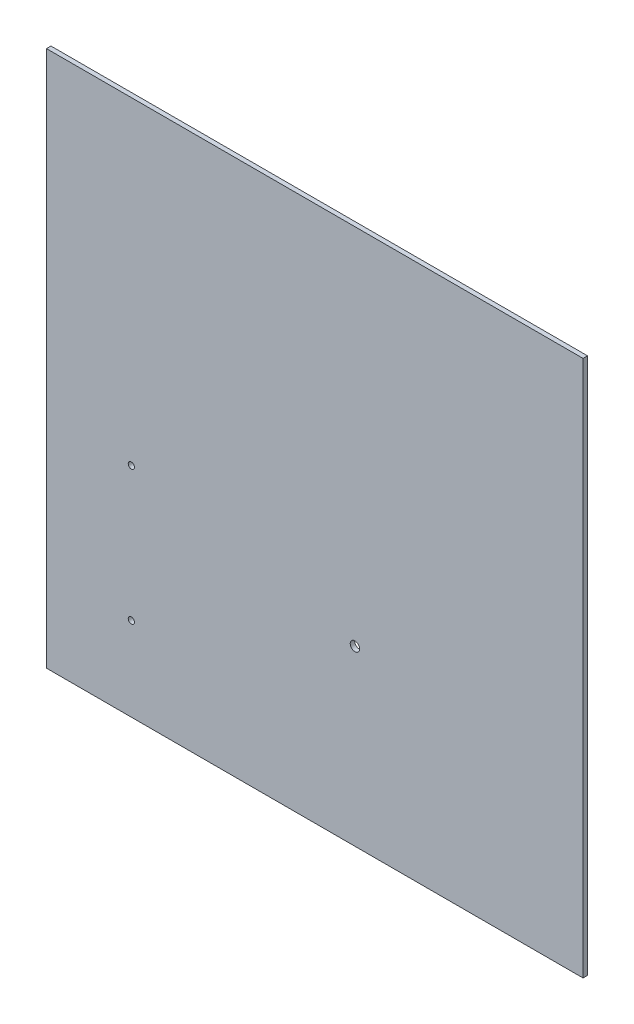
ISO-10303-21;
HEADER;
FILE_DESCRIPTION(('STEP AP214'),'2;1');
FILE_NAME('part.step','',(''),(''),'','','');
FILE_SCHEMA(('AUTOMOTIVE_DESIGN { 1 0 10303 214 1 1 1 1 }'));
ENDSEC;
DATA;
#1=APPLICATION_CONTEXT('core data for automotive mechanical design processes');
#2=APPLICATION_PROTOCOL_DEFINITION('international standard','automotive_design',2000,#1);
#3=PRODUCT_CONTEXT('',#1,'mechanical');
#4=PRODUCT('Part','Part','',(#3));
#5=PRODUCT_RELATED_PRODUCT_CATEGORY('part','',(#4));
#6=PRODUCT_DEFINITION_FORMATION('','',#4);
#7=PRODUCT_DEFINITION_CONTEXT('part definition',#1,'design');
#8=PRODUCT_DEFINITION('design','',#6,#7);
#9=PRODUCT_DEFINITION_SHAPE('','',#8);
#10=(LENGTH_UNIT() NAMED_UNIT(*) SI_UNIT(.MILLI.,.METRE.));
#11=(NAMED_UNIT(*) PLANE_ANGLE_UNIT() SI_UNIT($,.RADIAN.));
#12=(NAMED_UNIT(*) SI_UNIT($,.STERADIAN.) SOLID_ANGLE_UNIT());
#13=UNCERTAINTY_MEASURE_WITH_UNIT(LENGTH_MEASURE(1.E-05),#10,'distance_accuracy_value','');
#14=(GEOMETRIC_REPRESENTATION_CONTEXT(3) GLOBAL_UNCERTAINTY_ASSIGNED_CONTEXT((#13)) GLOBAL_UNIT_ASSIGNED_CONTEXT((#10,
#11,#12)) REPRESENTATION_CONTEXT('',''));
#15=CARTESIAN_POINT('',(0.,0.,0.));
#16=DIRECTION('',(0.,0.,1.));
#17=DIRECTION('',(1.,0.,0.));
#18=AXIS2_PLACEMENT_3D('',#15,#16,#17);
#19=CARTESIAN_POINT('',(0.,0.,2.54));
#20=DIRECTION('',(1.,0.,0.));
#21=DIRECTION('',(0.,0.,-1.));
#22=AXIS2_PLACEMENT_3D('',#19,#20,#21);
#23=PLANE('',#22);
#24=DIRECTION('',(0.,-1.,0.));
#25=VECTOR('',#24,1.);
#26=CARTESIAN_POINT('',(0.,0.,0.));
#27=LINE('',#26,#25);
#28=CARTESIAN_POINT('',(0.,304.8,0.));
#29=VERTEX_POINT('',#28);
#30=CARTESIAN_POINT('',(0.,0.,0.));
#31=VERTEX_POINT('',#30);
#32=EDGE_CURVE('E95',#29,#31,#27,.T.);
#33=ORIENTED_EDGE('',*,*,#32,.T.);
#34=DIRECTION('',(0.,0.,-1.));
#35=VECTOR('',#34,1.);
#36=CARTESIAN_POINT('',(0.,0.,2.54));
#37=LINE('',#36,#35);
#38=CARTESIAN_POINT('',(0.,0.,2.54));
#39=VERTEX_POINT('',#38);
#40=EDGE_CURVE('E11',#39,#31,#37,.T.);
#41=ORIENTED_EDGE('',*,*,#40,.F.);
#42=DIRECTION('',(0.,-1.,0.));
#43=VECTOR('',#42,1.);
#44=CARTESIAN_POINT('',(0.,0.,2.54));
#45=LINE('',#44,#43);
#46=CARTESIAN_POINT('',(0.,304.8,2.54));
#47=VERTEX_POINT('',#46);
#48=EDGE_CURVE('E83',#47,#39,#45,.T.);
#49=ORIENTED_EDGE('',*,*,#48,.F.);
#50=DIRECTION('',(0.,0.,-1.));
#51=VECTOR('',#50,1.);
#52=CARTESIAN_POINT('',(0.,304.8,2.54));
#53=LINE('',#52,#51);
#54=EDGE_CURVE('E91',#47,#29,#53,.T.);
#55=ORIENTED_EDGE('',*,*,#54,.T.);
#56=EDGE_LOOP('',(#33,#41,#49,#55));
#57=FACE_BOUND('',#56,.T.);
#58=ADVANCED_FACE('F32',(#57),#23,.F.);
#59=CARTESIAN_POINT('',(0.,0.,2.54));
#60=DIRECTION('',(0.,1.,0.));
#61=DIRECTION('',(0.,0.,1.));
#62=AXIS2_PLACEMENT_3D('',#59,#60,#61);
#63=PLANE('',#62);
#64=DIRECTION('',(1.,0.,0.));
#65=VECTOR('',#64,1.);
#66=CARTESIAN_POINT('',(0.,0.,0.));
#67=LINE('',#66,#65);
#68=CARTESIAN_POINT('',(304.8,0.,0.));
#69=VERTEX_POINT('',#68);
#70=EDGE_CURVE('E87',#31,#69,#67,.T.);
#71=ORIENTED_EDGE('',*,*,#70,.T.);
#72=DIRECTION('',(0.,0.,-1.));
#73=VECTOR('',#72,1.);
#74=CARTESIAN_POINT('',(304.8,0.,2.54));
#75=LINE('',#74,#73);
#76=CARTESIAN_POINT('',(304.8,0.,2.54));
#77=VERTEX_POINT('',#76);
#78=EDGE_CURVE('E40',#77,#69,#75,.T.);
#79=ORIENTED_EDGE('',*,*,#78,.F.);
#80=DIRECTION('',(1.,0.,0.));
#81=VECTOR('',#80,1.);
#82=CARTESIAN_POINT('',(0.,0.,2.54));
#83=LINE('',#82,#81);
#84=EDGE_CURVE('E78',#39,#77,#83,.T.);
#85=ORIENTED_EDGE('',*,*,#84,.F.);
#86=ORIENTED_EDGE('',*,*,#40,.T.);
#87=EDGE_LOOP('',(#71,#79,#85,#86));
#88=FACE_BOUND('',#87,.T.);
#89=ADVANCED_FACE('F86',(#88),#63,.F.);
#90=CARTESIAN_POINT('',(304.8,0.,2.54));
#91=DIRECTION('',(-1.,0.,0.));
#92=DIRECTION('',(0.,0.,1.));
#93=AXIS2_PLACEMENT_3D('',#90,#91,#92);
#94=PLANE('',#93);
#95=DIRECTION('',(0.,1.,0.));
#96=VECTOR('',#95,1.);
#97=CARTESIAN_POINT('',(304.8,0.,0.));
#98=LINE('',#97,#96);
#99=CARTESIAN_POINT('',(304.8,304.8,0.));
#100=VERTEX_POINT('',#99);
#101=EDGE_CURVE('E65',#69,#100,#98,.T.);
#102=ORIENTED_EDGE('',*,*,#101,.T.);
#103=DIRECTION('',(0.,0.,-1.));
#104=VECTOR('',#103,1.);
#105=CARTESIAN_POINT('',(304.8,304.8,2.54));
#106=LINE('',#105,#104);
#107=CARTESIAN_POINT('',(304.8,304.8,2.54));
#108=VERTEX_POINT('',#107);
#109=EDGE_CURVE('E88',#108,#100,#106,.T.);
#110=ORIENTED_EDGE('',*,*,#109,.F.);
#111=DIRECTION('',(0.,1.,0.));
#112=VECTOR('',#111,1.);
#113=CARTESIAN_POINT('',(304.8,0.,2.54));
#114=LINE('',#113,#112);
#115=EDGE_CURVE('E81',#77,#108,#114,.T.);
#116=ORIENTED_EDGE('',*,*,#115,.F.);
#117=ORIENTED_EDGE('',*,*,#78,.T.);
#118=EDGE_LOOP('',(#102,#110,#116,#117));
#119=FACE_BOUND('',#118,.T.);
#120=ADVANCED_FACE('F89',(#119),#94,.F.);
#121=CARTESIAN_POINT('',(0.,304.8,2.54));
#122=DIRECTION('',(0.,-1.,0.));
#123=DIRECTION('',(0.,0.,-1.));
#124=AXIS2_PLACEMENT_3D('',#121,#122,#123);
#125=PLANE('',#124);
#126=DIRECTION('',(-1.,0.,0.));
#127=VECTOR('',#126,1.);
#128=CARTESIAN_POINT('',(0.,304.8,0.));
#129=LINE('',#128,#127);
#130=EDGE_CURVE('E71',#100,#29,#129,.T.);
#131=ORIENTED_EDGE('',*,*,#130,.T.);
#132=ORIENTED_EDGE('',*,*,#54,.F.);
#133=DIRECTION('',(-1.,0.,0.));
#134=VECTOR('',#133,1.);
#135=CARTESIAN_POINT('',(0.,304.8,2.54));
#136=LINE('',#135,#134);
#137=EDGE_CURVE('E48',#108,#47,#136,.T.);
#138=ORIENTED_EDGE('',*,*,#137,.F.);
#139=ORIENTED_EDGE('',*,*,#109,.T.);
#140=EDGE_LOOP('',(#131,#132,#138,#139));
#141=FACE_BOUND('',#140,.T.);
#142=ADVANCED_FACE('F103',(#141),#125,.F.);
#143=CARTESIAN_POINT('',(0.,0.,2.54));
#144=DIRECTION('',(0.,0.,-1.));
#145=DIRECTION('',(-1.,0.,0.));
#146=AXIS2_PLACEMENT_3D('',#143,#144,#145);
#147=PLANE('',#146);
#148=CARTESIAN_POINT('',(48.2049917451685,47.5896668932699,2.54));
#149=DIRECTION('',(0.,0.,-1.));
#150=DIRECTION('',(-1.,0.,0.));
#151=AXIS2_PLACEMENT_3D('',#148,#149,#150);
#152=CIRCLE('',#151,1.7526);
#153=CARTESIAN_POINT('',(46.4523917451685,47.5896668932699,2.54));
#154=VERTEX_POINT('',#153);
#155=EDGE_CURVE('E98',#154,#154,#152,.T.);
#156=ORIENTED_EDGE('',*,*,#155,.T.);
#157=EDGE_LOOP('',(#156));
#158=FACE_BOUND('',#157,.T.);
#159=CARTESIAN_POINT('',(175.204991745169,98.3896668932699,2.54));
#160=DIRECTION('',(0.,0.,-1.));
#161=DIRECTION('',(-1.,0.,0.));
#162=AXIS2_PLACEMENT_3D('',#159,#160,#161);
#163=CIRCLE('',#162,2.667);
#164=CARTESIAN_POINT('',(172.537991745169,98.3896668932699,2.54));
#165=VERTEX_POINT('',#164);
#166=EDGE_CURVE('E111',#165,#165,#163,.T.);
#167=ORIENTED_EDGE('',*,*,#166,.T.);
#168=EDGE_LOOP('',(#167));
#169=FACE_BOUND('',#168,.T.);
#170=CARTESIAN_POINT('',(48.2049917451685,123.78966689327,2.54));
#171=DIRECTION('',(0.,0.,-1.));
#172=DIRECTION('',(-1.,0.,0.));
#173=AXIS2_PLACEMENT_3D('',#170,#171,#172);
#174=CIRCLE('',#173,1.7526);
#175=CARTESIAN_POINT('',(46.4523917451685,123.78966689327,2.54));
#176=VERTEX_POINT('',#175);
#177=EDGE_CURVE('E114',#176,#176,#174,.T.);
#178=ORIENTED_EDGE('',*,*,#177,.T.);
#179=EDGE_LOOP('',(#178));
#180=FACE_BOUND('',#179,.T.);
#181=ORIENTED_EDGE('',*,*,#48,.T.);
#182=ORIENTED_EDGE('',*,*,#84,.T.);
#183=ORIENTED_EDGE('',*,*,#115,.T.);
#184=ORIENTED_EDGE('',*,*,#137,.T.);
#185=EDGE_LOOP('',(#181,#182,#183,#184));
#186=FACE_BOUND('',#185,.T.);
#187=ADVANCED_FACE('F79',(#158,#169,#180,#186),#147,.F.);
#188=CARTESIAN_POINT('',(0.,0.,0.));
#189=DIRECTION('',(0.,0.,-1.));
#190=DIRECTION('',(-1.,0.,0.));
#191=AXIS2_PLACEMENT_3D('',#188,#189,#190);
#192=PLANE('',#191);
#193=CARTESIAN_POINT('',(48.2049917451685,47.5896668932699,0.));
#194=DIRECTION('',(0.,0.,1.));
#195=DIRECTION('',(1.,0.,0.));
#196=AXIS2_PLACEMENT_3D('',#193,#194,#195);
#197=CIRCLE('',#196,1.7526);
#198=CARTESIAN_POINT('',(49.9575917451685,47.5896668932699,0.));
#199=VERTEX_POINT('',#198);
#200=EDGE_CURVE('E117',#199,#199,#197,.T.);
#201=ORIENTED_EDGE('',*,*,#200,.T.);
#202=EDGE_LOOP('',(#201));
#203=FACE_BOUND('',#202,.T.);
#204=CARTESIAN_POINT('',(175.204991745169,98.3896668932699,0.));
#205=DIRECTION('',(0.,0.,1.));
#206=DIRECTION('',(1.,0.,0.));
#207=AXIS2_PLACEMENT_3D('',#204,#205,#206);
#208=CIRCLE('',#207,2.667);
#209=CARTESIAN_POINT('',(177.871991745169,98.3896668932699,0.));
#210=VERTEX_POINT('',#209);
#211=EDGE_CURVE('E121',#210,#210,#208,.T.);
#212=ORIENTED_EDGE('',*,*,#211,.T.);
#213=EDGE_LOOP('',(#212));
#214=FACE_BOUND('',#213,.T.);
#215=CARTESIAN_POINT('',(48.2049917451685,123.78966689327,0.));
#216=DIRECTION('',(0.,0.,1.));
#217=DIRECTION('',(1.,0.,0.));
#218=AXIS2_PLACEMENT_3D('',#215,#216,#217);
#219=CIRCLE('',#218,1.7526);
#220=CARTESIAN_POINT('',(49.9575917451685,123.78966689327,0.));
#221=VERTEX_POINT('',#220);
#222=EDGE_CURVE('E118',#221,#221,#219,.T.);
#223=ORIENTED_EDGE('',*,*,#222,.T.);
#224=EDGE_LOOP('',(#223));
#225=FACE_BOUND('',#224,.T.);
#226=ORIENTED_EDGE('',*,*,#32,.F.);
#227=ORIENTED_EDGE('',*,*,#130,.F.);
#228=ORIENTED_EDGE('',*,*,#101,.F.);
#229=ORIENTED_EDGE('',*,*,#70,.F.);
#230=EDGE_LOOP('',(#226,#227,#228,#229));
#231=FACE_BOUND('',#230,.T.);
#232=ADVANCED_FACE('F106',(#203,#214,#225,#231),#192,.T.);
#233=CARTESIAN_POINT('',(48.2049917451685,123.78966689327,0.));
#234=DIRECTION('',(0.,0.,1.));
#235=DIRECTION('',(1.,0.,0.));
#236=AXIS2_PLACEMENT_3D('',#233,#234,#235);
#237=CYLINDRICAL_SURFACE('',#236,1.7526);
#238=ORIENTED_EDGE('',*,*,#222,.F.);
#239=EDGE_LOOP('',(#238));
#240=FACE_BOUND('',#239,.T.);
#241=ORIENTED_EDGE('',*,*,#177,.F.);
#242=EDGE_LOOP('',(#241));
#243=FACE_BOUND('',#242,.T.);
#244=ADVANCED_FACE('F143',(#240,#243),#237,.F.);
#245=CARTESIAN_POINT('',(175.204991745169,98.3896668932699,0.));
#246=DIRECTION('',(0.,0.,1.));
#247=DIRECTION('',(1.,0.,0.));
#248=AXIS2_PLACEMENT_3D('',#245,#246,#247);
#249=CYLINDRICAL_SURFACE('',#248,2.667);
#250=ORIENTED_EDGE('',*,*,#211,.F.);
#251=EDGE_LOOP('',(#250));
#252=FACE_BOUND('',#251,.T.);
#253=ORIENTED_EDGE('',*,*,#166,.F.);
#254=EDGE_LOOP('',(#253));
#255=FACE_BOUND('',#254,.T.);
#256=ADVANCED_FACE('F132',(#252,#255),#249,.F.);
#257=CARTESIAN_POINT('',(48.2049917451685,47.5896668932699,0.));
#258=DIRECTION('',(0.,0.,1.));
#259=DIRECTION('',(1.,0.,0.));
#260=AXIS2_PLACEMENT_3D('',#257,#258,#259);
#261=CYLINDRICAL_SURFACE('',#260,1.7526);
#262=ORIENTED_EDGE('',*,*,#200,.F.);
#263=EDGE_LOOP('',(#262));
#264=FACE_BOUND('',#263,.T.);
#265=ORIENTED_EDGE('',*,*,#155,.F.);
#266=EDGE_LOOP('',(#265));
#267=FACE_BOUND('',#266,.T.);
#268=ADVANCED_FACE('F129',(#264,#267),#261,.F.);
#269=CLOSED_SHELL('',(#58,#89,#120,#142,#187,#232,#244,#256,#268));
#270=MANIFOLD_SOLID_BREP('B2',#269);
#271=ADVANCED_BREP_SHAPE_REPRESENTATION('',(#18,#270),#14);
#272=SHAPE_DEFINITION_REPRESENTATION(#9,#271);
ENDSEC;
END-ISO-10303-21;
